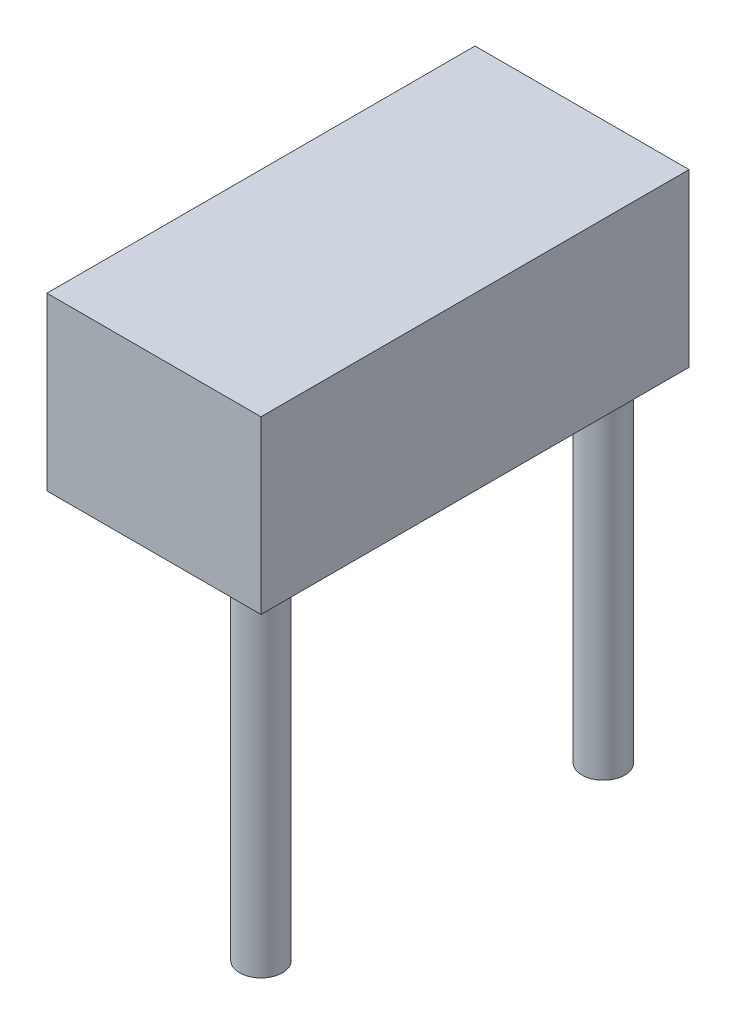
ISO-10303-21;
HEADER;
FILE_DESCRIPTION(('STEP AP214'),'2;1');
FILE_NAME('part.step','',(''),(''),'','','');
FILE_SCHEMA(('AUTOMOTIVE_DESIGN { 1 0 10303 214 1 1 1 1 }'));
ENDSEC;
DATA;
#1=APPLICATION_CONTEXT('core data for automotive mechanical design processes');
#2=APPLICATION_PROTOCOL_DEFINITION('international standard','automotive_design',2000,#1);
#3=PRODUCT_CONTEXT('',#1,'mechanical');
#4=PRODUCT('Part','Part','',(#3));
#5=PRODUCT_RELATED_PRODUCT_CATEGORY('part','',(#4));
#6=PRODUCT_DEFINITION_FORMATION('','',#4);
#7=PRODUCT_DEFINITION_CONTEXT('part definition',#1,'design');
#8=PRODUCT_DEFINITION('design','',#6,#7);
#9=PRODUCT_DEFINITION_SHAPE('','',#8);
#10=(LENGTH_UNIT() NAMED_UNIT(*) SI_UNIT(.MILLI.,.METRE.));
#11=(NAMED_UNIT(*) PLANE_ANGLE_UNIT() SI_UNIT($,.RADIAN.));
#12=(NAMED_UNIT(*) SI_UNIT($,.STERADIAN.) SOLID_ANGLE_UNIT());
#13=UNCERTAINTY_MEASURE_WITH_UNIT(LENGTH_MEASURE(1.E-05),#10,'distance_accuracy_value','');
#14=(GEOMETRIC_REPRESENTATION_CONTEXT(3) GLOBAL_UNCERTAINTY_ASSIGNED_CONTEXT((#13)) GLOBAL_UNIT_ASSIGNED_CONTEXT((#10,
#11,#12)) REPRESENTATION_CONTEXT('',''));
#15=CARTESIAN_POINT('',(0.,0.,0.));
#16=DIRECTION('',(0.,0.,1.));
#17=DIRECTION('',(1.,0.,0.));
#18=AXIS2_PLACEMENT_3D('',#15,#16,#17);
#19=CARTESIAN_POINT('',(0.,0.,0.));
#20=DIRECTION('',(0.,-1.,0.));
#21=DIRECTION('',(0.,0.,-1.));
#22=AXIS2_PLACEMENT_3D('',#19,#20,#21);
#23=PLANE('',#22);
#24=CARTESIAN_POINT('',(12.7,0.,-3.175));
#25=DIRECTION('',(0.,-1.,0.));
#26=DIRECTION('',(0.,0.,-1.));
#27=AXIS2_PLACEMENT_3D('',#24,#25,#26);
#28=CIRCLE('',#27,1.5875);
#29=CARTESIAN_POINT('',(12.7,0.,-4.7625));
#30=VERTEX_POINT('',#29);
#31=EDGE_CURVE('E111',#30,#30,#28,.T.);
#32=ORIENTED_EDGE('',*,*,#31,.F.);
#33=EDGE_LOOP('',(#32));
#34=FACE_BOUND('',#33,.T.);
#35=DIRECTION('',(0.,0.,1.));
#36=VECTOR('',#35,1.);
#37=CARTESIAN_POINT('',(0.,0.,0.));
#38=LINE('',#37,#36);
#39=CARTESIAN_POINT('',(0.,0.,-31.75));
#40=VERTEX_POINT('',#39);
#41=CARTESIAN_POINT('',(0.,0.,0.));
#42=VERTEX_POINT('',#41);
#43=EDGE_CURVE('E97',#40,#42,#38,.T.);
#44=ORIENTED_EDGE('',*,*,#43,.F.);
#45=DIRECTION('',(-1.,0.,0.));
#46=VECTOR('',#45,1.);
#47=CARTESIAN_POINT('',(0.,0.,-31.75));
#48=LINE('',#47,#46);
#49=CARTESIAN_POINT('',(15.875,0.,-31.75));
#50=VERTEX_POINT('',#49);
#51=EDGE_CURVE('E73',#50,#40,#48,.T.);
#52=ORIENTED_EDGE('',*,*,#51,.F.);
#53=DIRECTION('',(0.,0.,-1.));
#54=VECTOR('',#53,1.);
#55=CARTESIAN_POINT('',(15.875,0.,0.));
#56=LINE('',#55,#54);
#57=CARTESIAN_POINT('',(15.875,0.,0.));
#58=VERTEX_POINT('',#57);
#59=EDGE_CURVE('E67',#58,#50,#56,.T.);
#60=ORIENTED_EDGE('',*,*,#59,.F.);
#61=DIRECTION('',(1.,0.,0.));
#62=VECTOR('',#61,1.);
#63=CARTESIAN_POINT('',(0.,0.,0.));
#64=LINE('',#63,#62);
#65=EDGE_CURVE('E89',#42,#58,#64,.T.);
#66=ORIENTED_EDGE('',*,*,#65,.F.);
#67=EDGE_LOOP('',(#44,#52,#60,#66));
#68=FACE_BOUND('',#67,.T.);
#69=CARTESIAN_POINT('',(12.7,0.,-28.575));
#70=DIRECTION('',(0.,-1.,0.));
#71=DIRECTION('',(0.,0.,1.));
#72=AXIS2_PLACEMENT_3D('',#69,#70,#71);
#73=CIRCLE('',#72,1.5875);
#74=CARTESIAN_POINT('',(12.7,0.,-26.9875));
#75=VERTEX_POINT('',#74);
#76=EDGE_CURVE('E117',#75,#75,#73,.T.);
#77=ORIENTED_EDGE('',*,*,#76,.F.);
#78=EDGE_LOOP('',(#77));
#79=FACE_BOUND('',#78,.T.);
#80=ADVANCED_FACE('F33',(#34,#68,#79),#23,.T.);
#81=CARTESIAN_POINT('',(0.,12.7,0.));
#82=DIRECTION('',(1.,0.,0.));
#83=DIRECTION('',(0.,0.,-1.));
#84=AXIS2_PLACEMENT_3D('',#81,#82,#83);
#85=PLANE('',#84);
#86=ORIENTED_EDGE('',*,*,#43,.T.);
#87=DIRECTION('',(0.,-1.,0.));
#88=VECTOR('',#87,1.);
#89=CARTESIAN_POINT('',(0.,12.7,0.));
#90=LINE('',#89,#88);
#91=CARTESIAN_POINT('',(0.,12.7,0.));
#92=VERTEX_POINT('',#91);
#93=EDGE_CURVE('E11',#92,#42,#90,.T.);
#94=ORIENTED_EDGE('',*,*,#93,.F.);
#95=DIRECTION('',(0.,0.,1.));
#96=VECTOR('',#95,1.);
#97=CARTESIAN_POINT('',(0.,12.7,0.));
#98=LINE('',#97,#96);
#99=CARTESIAN_POINT('',(0.,12.7,-31.75));
#100=VERTEX_POINT('',#99);
#101=EDGE_CURVE('E85',#100,#92,#98,.T.);
#102=ORIENTED_EDGE('',*,*,#101,.F.);
#103=DIRECTION('',(0.,-1.,0.));
#104=VECTOR('',#103,1.);
#105=CARTESIAN_POINT('',(0.,12.7,-31.75));
#106=LINE('',#105,#104);
#107=EDGE_CURVE('E93',#100,#40,#106,.T.);
#108=ORIENTED_EDGE('',*,*,#107,.T.);
#109=EDGE_LOOP('',(#86,#94,#102,#108));
#110=FACE_BOUND('',#109,.T.);
#111=ADVANCED_FACE('F35',(#110),#85,.F.);
#112=CARTESIAN_POINT('',(0.,12.7,0.));
#113=DIRECTION('',(0.,0.,-1.));
#114=DIRECTION('',(-1.,0.,0.));
#115=AXIS2_PLACEMENT_3D('',#112,#113,#114);
#116=PLANE('',#115);
#117=ORIENTED_EDGE('',*,*,#65,.T.);
#118=DIRECTION('',(0.,-1.,0.));
#119=VECTOR('',#118,1.);
#120=CARTESIAN_POINT('',(15.875,12.7,0.));
#121=LINE('',#120,#119);
#122=CARTESIAN_POINT('',(15.875,12.7,0.));
#123=VERTEX_POINT('',#122);
#124=EDGE_CURVE('E42',#123,#58,#121,.T.);
#125=ORIENTED_EDGE('',*,*,#124,.F.);
#126=DIRECTION('',(1.,0.,0.));
#127=VECTOR('',#126,1.);
#128=CARTESIAN_POINT('',(0.,12.7,0.));
#129=LINE('',#128,#127);
#130=EDGE_CURVE('E80',#92,#123,#129,.T.);
#131=ORIENTED_EDGE('',*,*,#130,.F.);
#132=ORIENTED_EDGE('',*,*,#93,.T.);
#133=EDGE_LOOP('',(#117,#125,#131,#132));
#134=FACE_BOUND('',#133,.T.);
#135=ADVANCED_FACE('F88',(#134),#116,.F.);
#136=CARTESIAN_POINT('',(15.875,12.7,0.));
#137=DIRECTION('',(-1.,0.,0.));
#138=DIRECTION('',(0.,0.,1.));
#139=AXIS2_PLACEMENT_3D('',#136,#137,#138);
#140=PLANE('',#139);
#141=ORIENTED_EDGE('',*,*,#59,.T.);
#142=DIRECTION('',(0.,-1.,0.));
#143=VECTOR('',#142,1.);
#144=CARTESIAN_POINT('',(15.875,12.7,-31.75));
#145=LINE('',#144,#143);
#146=CARTESIAN_POINT('',(15.875,12.7,-31.75));
#147=VERTEX_POINT('',#146);
#148=EDGE_CURVE('E90',#147,#50,#145,.T.);
#149=ORIENTED_EDGE('',*,*,#148,.F.);
#150=DIRECTION('',(0.,0.,-1.));
#151=VECTOR('',#150,1.);
#152=CARTESIAN_POINT('',(15.875,12.7,0.));
#153=LINE('',#152,#151);
#154=EDGE_CURVE('E83',#123,#147,#153,.T.);
#155=ORIENTED_EDGE('',*,*,#154,.F.);
#156=ORIENTED_EDGE('',*,*,#124,.T.);
#157=EDGE_LOOP('',(#141,#149,#155,#156));
#158=FACE_BOUND('',#157,.T.);
#159=ADVANCED_FACE('F91',(#158),#140,.F.);
#160=CARTESIAN_POINT('',(0.,12.7,-31.75));
#161=DIRECTION('',(0.,0.,1.));
#162=DIRECTION('',(1.,0.,0.));
#163=AXIS2_PLACEMENT_3D('',#160,#161,#162);
#164=PLANE('',#163);
#165=ORIENTED_EDGE('',*,*,#51,.T.);
#166=ORIENTED_EDGE('',*,*,#107,.F.);
#167=DIRECTION('',(-1.,0.,0.));
#168=VECTOR('',#167,1.);
#169=CARTESIAN_POINT('',(0.,12.7,-31.75));
#170=LINE('',#169,#168);
#171=EDGE_CURVE('E50',#147,#100,#170,.T.);
#172=ORIENTED_EDGE('',*,*,#171,.F.);
#173=ORIENTED_EDGE('',*,*,#148,.T.);
#174=EDGE_LOOP('',(#165,#166,#172,#173));
#175=FACE_BOUND('',#174,.T.);
#176=ADVANCED_FACE('F105',(#175),#164,.F.);
#177=CARTESIAN_POINT('',(0.,12.7,0.));
#178=DIRECTION('',(0.,-1.,0.));
#179=DIRECTION('',(0.,0.,-1.));
#180=AXIS2_PLACEMENT_3D('',#177,#178,#179);
#181=PLANE('',#180);
#182=ORIENTED_EDGE('',*,*,#101,.T.);
#183=ORIENTED_EDGE('',*,*,#130,.T.);
#184=ORIENTED_EDGE('',*,*,#154,.T.);
#185=ORIENTED_EDGE('',*,*,#171,.T.);
#186=EDGE_LOOP('',(#182,#183,#184,#185));
#187=FACE_BOUND('',#186,.T.);
#188=ADVANCED_FACE('F81',(#187),#181,.F.);
#189=CARTESIAN_POINT('',(12.7,-25.4,-3.175));
#190=DIRECTION('',(0.,1.,0.));
#191=DIRECTION('',(0.,0.,1.));
#192=AXIS2_PLACEMENT_3D('',#189,#190,#191);
#193=CYLINDRICAL_SURFACE('',#192,1.5875);
#194=CARTESIAN_POINT('',(12.7,-25.4,-3.175));
#195=DIRECTION('',(0.,-1.,0.));
#196=DIRECTION('',(0.,0.,-1.));
#197=AXIS2_PLACEMENT_3D('',#194,#195,#196);
#198=CIRCLE('',#197,1.5875);
#199=CARTESIAN_POINT('',(12.7,-25.4,-4.7625));
#200=VERTEX_POINT('',#199);
#201=EDGE_CURVE('E100',#200,#200,#198,.T.);
#202=ORIENTED_EDGE('',*,*,#201,.F.);
#203=EDGE_LOOP('',(#202));
#204=FACE_BOUND('',#203,.T.);
#205=ORIENTED_EDGE('',*,*,#31,.T.);
#206=EDGE_LOOP('',(#205));
#207=FACE_BOUND('',#206,.T.);
#208=ADVANCED_FACE('F163',(#204,#207),#193,.T.);
#209=CARTESIAN_POINT('',(12.7,-25.4,-3.175));
#210=DIRECTION('',(0.,-1.,0.));
#211=DIRECTION('',(0.,0.,-1.));
#212=AXIS2_PLACEMENT_3D('',#209,#210,#211);
#213=PLANE('',#212);
#214=ORIENTED_EDGE('',*,*,#201,.T.);
#215=EDGE_LOOP('',(#214));
#216=FACE_BOUND('',#215,.T.);
#217=ADVANCED_FACE('F128',(#216),#213,.T.);
#218=CARTESIAN_POINT('',(12.7,-25.4,-28.575));
#219=DIRECTION('',(0.,1.,0.));
#220=DIRECTION('',(0.,0.,1.));
#221=AXIS2_PLACEMENT_3D('',#218,#219,#220);
#222=CYLINDRICAL_SURFACE('',#221,1.5875);
#223=CARTESIAN_POINT('',(12.7,-25.4,-28.575));
#224=DIRECTION('',(0.,-1.,0.));
#225=DIRECTION('',(0.,0.,1.));
#226=AXIS2_PLACEMENT_3D('',#223,#224,#225);
#227=CIRCLE('',#226,1.5875);
#228=CARTESIAN_POINT('',(12.7,-25.4,-26.9875));
#229=VERTEX_POINT('',#228);
#230=EDGE_CURVE('E114',#229,#229,#227,.T.);
#231=ORIENTED_EDGE('',*,*,#230,.F.);
#232=EDGE_LOOP('',(#231));
#233=FACE_BOUND('',#232,.T.);
#234=ORIENTED_EDGE('',*,*,#76,.T.);
#235=EDGE_LOOP('',(#234));
#236=FACE_BOUND('',#235,.T.);
#237=ADVANCED_FACE('F125',(#233,#236),#222,.T.);
#238=CARTESIAN_POINT('',(12.7,-25.4,-28.575));
#239=DIRECTION('',(0.,1.,0.));
#240=DIRECTION('',(0.,0.,1.));
#241=AXIS2_PLACEMENT_3D('',#238,#239,#240);
#242=PLANE('',#241);
#243=ORIENTED_EDGE('',*,*,#230,.T.);
#244=EDGE_LOOP('',(#243));
#245=FACE_BOUND('',#244,.T.);
#246=ADVANCED_FACE('F123',(#245),#242,.F.);
#247=CLOSED_SHELL('',(#80,#111,#135,#159,#176,#188,#208,#217,#237,#246));
#248=MANIFOLD_SOLID_BREP('B2',#247);
#249=ADVANCED_BREP_SHAPE_REPRESENTATION('',(#18,#248),#14);
#250=SHAPE_DEFINITION_REPRESENTATION(#9,#249);
ENDSEC;
END-ISO-10303-21;
